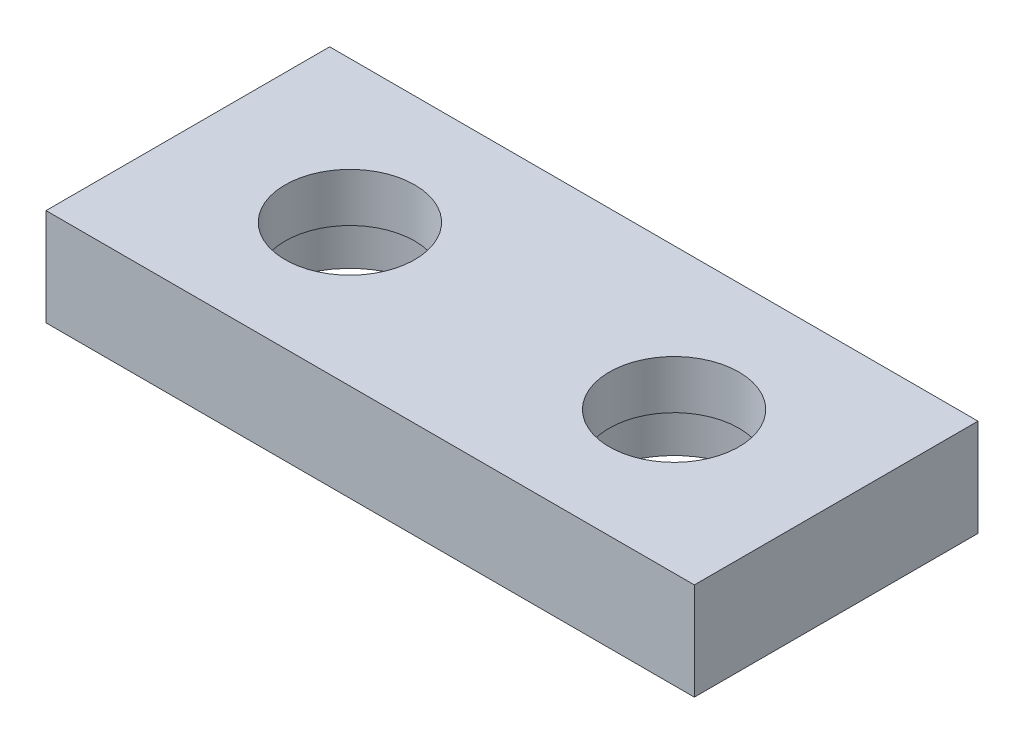
ISO-10303-21;
HEADER;
FILE_DESCRIPTION(('STEP AP214'),'2;1');
FILE_NAME('part.step','',(''),(''),'','','');
FILE_SCHEMA(('AUTOMOTIVE_DESIGN { 1 0 10303 214 1 1 1 1 }'));
ENDSEC;
DATA;
#1=APPLICATION_CONTEXT('core data for automotive mechanical design processes');
#2=APPLICATION_PROTOCOL_DEFINITION('international standard','automotive_design',2000,#1);
#3=PRODUCT_CONTEXT('',#1,'mechanical');
#4=PRODUCT('Part','Part','',(#3));
#5=PRODUCT_RELATED_PRODUCT_CATEGORY('part','',(#4));
#6=PRODUCT_DEFINITION_FORMATION('','',#4);
#7=PRODUCT_DEFINITION_CONTEXT('part definition',#1,'design');
#8=PRODUCT_DEFINITION('design','',#6,#7);
#9=PRODUCT_DEFINITION_SHAPE('','',#8);
#10=(LENGTH_UNIT() NAMED_UNIT(*) SI_UNIT(.MILLI.,.METRE.));
#11=(NAMED_UNIT(*) PLANE_ANGLE_UNIT() SI_UNIT($,.RADIAN.));
#12=(NAMED_UNIT(*) SI_UNIT($,.STERADIAN.) SOLID_ANGLE_UNIT());
#13=UNCERTAINTY_MEASURE_WITH_UNIT(LENGTH_MEASURE(1.E-05),#10,'distance_accuracy_value','');
#14=(GEOMETRIC_REPRESENTATION_CONTEXT(3) GLOBAL_UNCERTAINTY_ASSIGNED_CONTEXT((#13)) GLOBAL_UNIT_ASSIGNED_CONTEXT((#10,
#11,#12)) REPRESENTATION_CONTEXT('',''));
#15=CARTESIAN_POINT('',(0.,0.,0.));
#16=DIRECTION('',(0.,0.,1.));
#17=DIRECTION('',(1.,0.,0.));
#18=AXIS2_PLACEMENT_3D('',#15,#16,#17);
#19=CARTESIAN_POINT('',(-20.,6.,-8.74999999999999));
#20=DIRECTION('',(0.,1.,0.));
#21=DIRECTION('',(0.,0.,1.));
#22=AXIS2_PLACEMENT_3D('',#19,#20,#21);
#23=PLANE('',#22);
#24=DIRECTION('',(0.,0.,1.));
#25=VECTOR('',#24,1.);
#26=CARTESIAN_POINT('',(-20.,6.,8.75000000000001));
#27=LINE('',#26,#25);
#28=CARTESIAN_POINT('',(-20.,6.,-8.74999999999999));
#29=VERTEX_POINT('',#28);
#30=CARTESIAN_POINT('',(-20.,6.,8.75000000000001));
#31=VERTEX_POINT('',#30);
#32=EDGE_CURVE('E85',#29,#31,#27,.T.);
#33=ORIENTED_EDGE('',*,*,#32,.T.);
#34=DIRECTION('',(1.,0.,0.));
#35=VECTOR('',#34,1.);
#36=CARTESIAN_POINT('',(20.,6.,8.75));
#37=LINE('',#36,#35);
#38=CARTESIAN_POINT('',(20.,6.,8.75));
#39=VERTEX_POINT('',#38);
#40=EDGE_CURVE('E80',#31,#39,#37,.T.);
#41=ORIENTED_EDGE('',*,*,#40,.T.);
#42=DIRECTION('',(0.,0.,-1.));
#43=VECTOR('',#42,1.);
#44=CARTESIAN_POINT('',(20.,6.,8.75));
#45=LINE('',#44,#43);
#46=CARTESIAN_POINT('',(20.,6.,-8.75));
#47=VERTEX_POINT('',#46);
#48=EDGE_CURVE('E83',#39,#47,#45,.T.);
#49=ORIENTED_EDGE('',*,*,#48,.T.);
#50=DIRECTION('',(-1.,0.,0.));
#51=VECTOR('',#50,1.);
#52=CARTESIAN_POINT('',(20.,6.,-8.75));
#53=LINE('',#52,#51);
#54=EDGE_CURVE('E50',#47,#29,#53,.T.);
#55=ORIENTED_EDGE('',*,*,#54,.T.);
#56=EDGE_LOOP('',(#33,#41,#49,#55));
#57=FACE_BOUND('',#56,.T.);
#58=CARTESIAN_POINT('',(-10.,6.,0.));
#59=DIRECTION('',(0.,-1.,0.));
#60=DIRECTION('',(0.,0.,-1.));
#61=AXIS2_PLACEMENT_3D('',#58,#59,#60);
#62=CIRCLE('',#61,4.);
#63=CARTESIAN_POINT('',(-10.,6.,-4.));
#64=VERTEX_POINT('',#63);
#65=EDGE_CURVE('E115',#64,#64,#62,.T.);
#66=ORIENTED_EDGE('',*,*,#65,.T.);
#67=EDGE_LOOP('',(#66));
#68=FACE_BOUND('',#67,.T.);
#69=CARTESIAN_POINT('',(10.,6.,0.));
#70=DIRECTION('',(0.,1.,0.));
#71=DIRECTION('',(0.,0.,-1.));
#72=AXIS2_PLACEMENT_3D('',#69,#70,#71);
#73=CIRCLE('',#72,4.);
#74=CARTESIAN_POINT('',(10.,6.,-4.));
#75=VERTEX_POINT('',#74);
#76=EDGE_CURVE('E127',#75,#75,#73,.T.);
#77=ORIENTED_EDGE('',*,*,#76,.F.);
#78=EDGE_LOOP('',(#77));
#79=FACE_BOUND('',#78,.T.);
#80=ADVANCED_FACE('F33',(#57,#68,#79),#23,.T.);
#81=CARTESIAN_POINT('',(10.,3.,0.));
#82=DIRECTION('',(0.,-1.,0.));
#83=DIRECTION('',(0.,0.,-1.));
#84=AXIS2_PLACEMENT_3D('',#81,#82,#83);
#85=PLANE('',#84);
#86=CARTESIAN_POINT('',(10.,3.,0.));
#87=DIRECTION('',(0.,1.,0.));
#88=DIRECTION('',(0.,0.,-1.));
#89=AXIS2_PLACEMENT_3D('',#86,#87,#88);
#90=CIRCLE('',#89,5.);
#91=CARTESIAN_POINT('',(10.,3.,-5.));
#92=VERTEX_POINT('',#91);
#93=EDGE_CURVE('E121',#92,#92,#90,.T.);
#94=ORIENTED_EDGE('',*,*,#93,.F.);
#95=EDGE_LOOP('',(#94));
#96=FACE_BOUND('',#95,.T.);
#97=CARTESIAN_POINT('',(10.,3.,0.));
#98=DIRECTION('',(0.,1.,0.));
#99=DIRECTION('',(0.,0.,-1.));
#100=AXIS2_PLACEMENT_3D('',#97,#98,#99);
#101=CIRCLE('',#100,4.);
#102=CARTESIAN_POINT('',(10.,3.,-4.));
#103=VERTEX_POINT('',#102);
#104=EDGE_CURVE('E130',#103,#103,#101,.T.);
#105=ORIENTED_EDGE('',*,*,#104,.T.);
#106=EDGE_LOOP('',(#105));
#107=FACE_BOUND('',#106,.T.);
#108=ADVANCED_FACE('F140',(#96,#107),#85,.T.);
#109=CARTESIAN_POINT('',(-20.,0.,-8.74999999999999));
#110=DIRECTION('',(0.,1.,0.));
#111=DIRECTION('',(0.,0.,1.));
#112=AXIS2_PLACEMENT_3D('',#109,#110,#111);
#113=PLANE('',#112);
#114=DIRECTION('',(0.,0.,1.));
#115=VECTOR('',#114,1.);
#116=CARTESIAN_POINT('',(-20.,0.,8.75000000000001));
#117=LINE('',#116,#115);
#118=CARTESIAN_POINT('',(-20.,0.,-8.74999999999999));
#119=VERTEX_POINT('',#118);
#120=CARTESIAN_POINT('',(-20.,0.,8.75000000000001));
#121=VERTEX_POINT('',#120);
#122=EDGE_CURVE('E97',#119,#121,#117,.T.);
#123=ORIENTED_EDGE('',*,*,#122,.F.);
#124=DIRECTION('',(-1.,0.,0.));
#125=VECTOR('',#124,1.);
#126=CARTESIAN_POINT('',(20.,0.,-8.75));
#127=LINE('',#126,#125);
#128=CARTESIAN_POINT('',(20.,0.,-8.75));
#129=VERTEX_POINT('',#128);
#130=EDGE_CURVE('E73',#129,#119,#127,.T.);
#131=ORIENTED_EDGE('',*,*,#130,.F.);
#132=DIRECTION('',(0.,0.,-1.));
#133=VECTOR('',#132,1.);
#134=CARTESIAN_POINT('',(20.,0.,8.75));
#135=LINE('',#134,#133);
#136=CARTESIAN_POINT('',(20.,0.,8.75));
#137=VERTEX_POINT('',#136);
#138=EDGE_CURVE('E67',#137,#129,#135,.T.);
#139=ORIENTED_EDGE('',*,*,#138,.F.);
#140=DIRECTION('',(1.,0.,0.));
#141=VECTOR('',#140,1.);
#142=CARTESIAN_POINT('',(20.,0.,8.75));
#143=LINE('',#142,#141);
#144=EDGE_CURVE('E89',#121,#137,#143,.T.);
#145=ORIENTED_EDGE('',*,*,#144,.F.);
#146=EDGE_LOOP('',(#123,#131,#139,#145));
#147=FACE_BOUND('',#146,.T.);
#148=CARTESIAN_POINT('',(-10.,0.,0.));
#149=DIRECTION('',(0.,-1.,0.));
#150=DIRECTION('',(0.,0.,-1.));
#151=AXIS2_PLACEMENT_3D('',#148,#149,#150);
#152=CIRCLE('',#151,5.);
#153=CARTESIAN_POINT('',(-10.,0.,-5.));
#154=VERTEX_POINT('',#153);
#155=EDGE_CURVE('E112',#154,#154,#152,.T.);
#156=ORIENTED_EDGE('',*,*,#155,.F.);
#157=EDGE_LOOP('',(#156));
#158=FACE_BOUND('',#157,.T.);
#159=CARTESIAN_POINT('',(10.,0.,0.));
#160=DIRECTION('',(0.,1.,0.));
#161=DIRECTION('',(0.,0.,-1.));
#162=AXIS2_PLACEMENT_3D('',#159,#160,#161);
#163=CIRCLE('',#162,5.);
#164=CARTESIAN_POINT('',(10.,0.,-5.));
#165=VERTEX_POINT('',#164);
#166=EDGE_CURVE('E124',#165,#165,#163,.T.);
#167=ORIENTED_EDGE('',*,*,#166,.T.);
#168=EDGE_LOOP('',(#167));
#169=FACE_BOUND('',#168,.T.);
#170=ADVANCED_FACE('F108',(#147,#158,#169),#113,.F.);
#171=CARTESIAN_POINT('',(-20.,6.,8.75000000000001));
#172=DIRECTION('',(1.,0.,0.));
#173=DIRECTION('',(0.,0.,-1.));
#174=AXIS2_PLACEMENT_3D('',#171,#172,#173);
#175=PLANE('',#174);
#176=ORIENTED_EDGE('',*,*,#122,.T.);
#177=DIRECTION('',(0.,-1.,0.));
#178=VECTOR('',#177,1.);
#179=CARTESIAN_POINT('',(-20.,6.,8.75000000000001));
#180=LINE('',#179,#178);
#181=EDGE_CURVE('E11',#31,#121,#180,.T.);
#182=ORIENTED_EDGE('',*,*,#181,.F.);
#183=ORIENTED_EDGE('',*,*,#32,.F.);
#184=DIRECTION('',(0.,-1.,0.));
#185=VECTOR('',#184,1.);
#186=CARTESIAN_POINT('',(-20.,6.,-8.74999999999999));
#187=LINE('',#186,#185);
#188=EDGE_CURVE('E93',#29,#119,#187,.T.);
#189=ORIENTED_EDGE('',*,*,#188,.T.);
#190=EDGE_LOOP('',(#176,#182,#183,#189));
#191=FACE_BOUND('',#190,.T.);
#192=ADVANCED_FACE('F35',(#191),#175,.F.);
#193=CARTESIAN_POINT('',(20.,6.,8.75));
#194=DIRECTION('',(0.,0.,-1.));
#195=DIRECTION('',(-1.,0.,0.));
#196=AXIS2_PLACEMENT_3D('',#193,#194,#195);
#197=PLANE('',#196);
#198=ORIENTED_EDGE('',*,*,#144,.T.);
#199=DIRECTION('',(0.,-1.,0.));
#200=VECTOR('',#199,1.);
#201=CARTESIAN_POINT('',(20.,6.,8.75));
#202=LINE('',#201,#200);
#203=EDGE_CURVE('E42',#39,#137,#202,.T.);
#204=ORIENTED_EDGE('',*,*,#203,.F.);
#205=ORIENTED_EDGE('',*,*,#40,.F.);
#206=ORIENTED_EDGE('',*,*,#181,.T.);
#207=EDGE_LOOP('',(#198,#204,#205,#206));
#208=FACE_BOUND('',#207,.T.);
#209=ADVANCED_FACE('F88',(#208),#197,.F.);
#210=CARTESIAN_POINT('',(20.,6.,8.75));
#211=DIRECTION('',(-1.,0.,0.));
#212=DIRECTION('',(0.,0.,1.));
#213=AXIS2_PLACEMENT_3D('',#210,#211,#212);
#214=PLANE('',#213);
#215=ORIENTED_EDGE('',*,*,#138,.T.);
#216=DIRECTION('',(0.,-1.,0.));
#217=VECTOR('',#216,1.);
#218=CARTESIAN_POINT('',(20.,6.,-8.75));
#219=LINE('',#218,#217);
#220=EDGE_CURVE('E90',#47,#129,#219,.T.);
#221=ORIENTED_EDGE('',*,*,#220,.F.);
#222=ORIENTED_EDGE('',*,*,#48,.F.);
#223=ORIENTED_EDGE('',*,*,#203,.T.);
#224=EDGE_LOOP('',(#215,#221,#222,#223));
#225=FACE_BOUND('',#224,.T.);
#226=ADVANCED_FACE('F91',(#225),#214,.F.);
#227=CARTESIAN_POINT('',(20.,6.,-8.75));
#228=DIRECTION('',(0.,0.,1.));
#229=DIRECTION('',(1.,0.,0.));
#230=AXIS2_PLACEMENT_3D('',#227,#228,#229);
#231=PLANE('',#230);
#232=ORIENTED_EDGE('',*,*,#130,.T.);
#233=ORIENTED_EDGE('',*,*,#188,.F.);
#234=ORIENTED_EDGE('',*,*,#54,.F.);
#235=ORIENTED_EDGE('',*,*,#220,.T.);
#236=EDGE_LOOP('',(#232,#233,#234,#235));
#237=FACE_BOUND('',#236,.T.);
#238=ADVANCED_FACE('F105',(#237),#231,.F.);
#239=CARTESIAN_POINT('',(-10.,3.,0.));
#240=DIRECTION('',(0.,-1.,0.));
#241=DIRECTION('',(0.,0.,-1.));
#242=AXIS2_PLACEMENT_3D('',#239,#240,#241);
#243=CYLINDRICAL_SURFACE('',#242,5.);
#244=CARTESIAN_POINT('',(-10.,3.,0.));
#245=DIRECTION('',(0.,-1.,0.));
#246=DIRECTION('',(0.,0.,-1.));
#247=AXIS2_PLACEMENT_3D('',#244,#245,#246);
#248=CIRCLE('',#247,5.);
#249=CARTESIAN_POINT('',(-10.,3.,-5.));
#250=VERTEX_POINT('',#249);
#251=EDGE_CURVE('E100',#250,#250,#248,.T.);
#252=ORIENTED_EDGE('',*,*,#251,.F.);
#253=EDGE_LOOP('',(#252));
#254=FACE_BOUND('',#253,.T.);
#255=ORIENTED_EDGE('',*,*,#155,.T.);
#256=EDGE_LOOP('',(#255));
#257=FACE_BOUND('',#256,.T.);
#258=ADVANCED_FACE('F149',(#254,#257),#243,.F.);
#259=CARTESIAN_POINT('',(-10.,3.,0.));
#260=DIRECTION('',(0.,-1.,0.));
#261=DIRECTION('',(0.,0.,-1.));
#262=AXIS2_PLACEMENT_3D('',#259,#260,#261);
#263=PLANE('',#262);
#264=CARTESIAN_POINT('',(-10.,3.,0.));
#265=DIRECTION('',(0.,-1.,0.));
#266=DIRECTION('',(0.,0.,-1.));
#267=AXIS2_PLACEMENT_3D('',#264,#265,#266);
#268=CIRCLE('',#267,4.);
#269=CARTESIAN_POINT('',(-10.,3.,-4.));
#270=VERTEX_POINT('',#269);
#271=EDGE_CURVE('E118',#270,#270,#268,.T.);
#272=ORIENTED_EDGE('',*,*,#271,.F.);
#273=EDGE_LOOP('',(#272));
#274=FACE_BOUND('',#273,.T.);
#275=ORIENTED_EDGE('',*,*,#251,.T.);
#276=EDGE_LOOP('',(#275));
#277=FACE_BOUND('',#276,.T.);
#278=ADVANCED_FACE('F188',(#274,#277),#263,.T.);
#279=CARTESIAN_POINT('',(-10.,6.,0.));
#280=DIRECTION('',(0.,-1.,0.));
#281=DIRECTION('',(0.,0.,-1.));
#282=AXIS2_PLACEMENT_3D('',#279,#280,#281);
#283=CYLINDRICAL_SURFACE('',#282,4.);
#284=ORIENTED_EDGE('',*,*,#65,.F.);
#285=EDGE_LOOP('',(#284));
#286=FACE_BOUND('',#285,.T.);
#287=ORIENTED_EDGE('',*,*,#271,.T.);
#288=EDGE_LOOP('',(#287));
#289=FACE_BOUND('',#288,.T.);
#290=ADVANCED_FACE('F182',(#286,#289),#283,.F.);
#291=CARTESIAN_POINT('',(10.,3.,0.));
#292=DIRECTION('',(0.,-1.,0.));
#293=DIRECTION('',(0.,0.,-1.));
#294=AXIS2_PLACEMENT_3D('',#291,#292,#293);
#295=CYLINDRICAL_SURFACE('',#294,5.);
#296=ORIENTED_EDGE('',*,*,#93,.T.);
#297=EDGE_LOOP('',(#296));
#298=FACE_BOUND('',#297,.T.);
#299=ORIENTED_EDGE('',*,*,#166,.F.);
#300=EDGE_LOOP('',(#299));
#301=FACE_BOUND('',#300,.T.);
#302=ADVANCED_FACE('F187',(#298,#301),#295,.F.);
#303=CARTESIAN_POINT('',(10.,6.,0.));
#304=DIRECTION('',(0.,-1.,0.));
#305=DIRECTION('',(0.,0.,-1.));
#306=AXIS2_PLACEMENT_3D('',#303,#304,#305);
#307=CYLINDRICAL_SURFACE('',#306,4.);
#308=ORIENTED_EDGE('',*,*,#76,.T.);
#309=EDGE_LOOP('',(#308));
#310=FACE_BOUND('',#309,.T.);
#311=ORIENTED_EDGE('',*,*,#104,.F.);
#312=EDGE_LOOP('',(#311));
#313=FACE_BOUND('',#312,.T.);
#314=ADVANCED_FACE('F136',(#310,#313),#307,.F.);
#315=CLOSED_SHELL('',(#80,#108,#170,#192,#209,#226,#238,#258,#278,#290,#302,#314));
#316=MANIFOLD_SOLID_BREP('B2',#315);
#317=ADVANCED_BREP_SHAPE_REPRESENTATION('',(#18,#316),#14);
#318=SHAPE_DEFINITION_REPRESENTATION(#9,#317);
ENDSEC;
END-ISO-10303-21;
